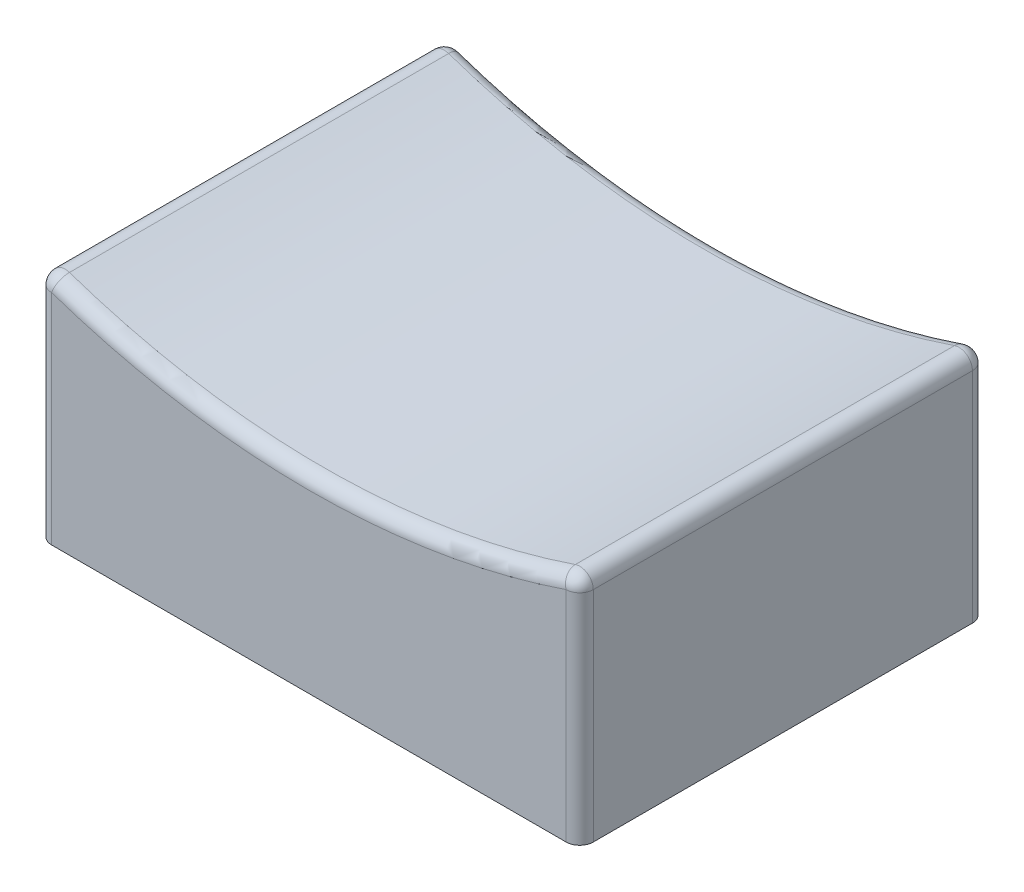
ISO-10303-21;
HEADER;
FILE_DESCRIPTION(('STEP AP214'),'2;1');
FILE_NAME('part.step','',(''),(''),'','','');
FILE_SCHEMA(('AUTOMOTIVE_DESIGN { 1 0 10303 214 1 1 1 1 }'));
ENDSEC;
DATA;
#1=APPLICATION_CONTEXT('core data for automotive mechanical design processes');
#2=APPLICATION_PROTOCOL_DEFINITION('international standard','automotive_design',2000,#1);
#3=PRODUCT_CONTEXT('',#1,'mechanical');
#4=PRODUCT('Part','Part','',(#3));
#5=PRODUCT_RELATED_PRODUCT_CATEGORY('part','',(#4));
#6=PRODUCT_DEFINITION_FORMATION('','',#4);
#7=PRODUCT_DEFINITION_CONTEXT('part definition',#1,'design');
#8=PRODUCT_DEFINITION('design','',#6,#7);
#9=PRODUCT_DEFINITION_SHAPE('','',#8);
#10=(LENGTH_UNIT() NAMED_UNIT(*) SI_UNIT(.MILLI.,.METRE.));
#11=(NAMED_UNIT(*) PLANE_ANGLE_UNIT() SI_UNIT($,.RADIAN.));
#12=(NAMED_UNIT(*) SI_UNIT($,.STERADIAN.) SOLID_ANGLE_UNIT());
#13=UNCERTAINTY_MEASURE_WITH_UNIT(LENGTH_MEASURE(1.E-05),#10,'distance_accuracy_value','');
#14=(GEOMETRIC_REPRESENTATION_CONTEXT(3) GLOBAL_UNCERTAINTY_ASSIGNED_CONTEXT((#13)) GLOBAL_UNIT_ASSIGNED_CONTEXT((#10,
#11,#12)) REPRESENTATION_CONTEXT('',''));
#15=CARTESIAN_POINT('',(0.,0.,0.));
#16=DIRECTION('',(0.,0.,1.));
#17=DIRECTION('',(1.,0.,0.));
#18=AXIS2_PLACEMENT_3D('',#15,#16,#17);
#19=CARTESIAN_POINT('',(0.,0.,15.));
#20=DIRECTION('',(1.,0.,0.));
#21=DIRECTION('',(0.,1.,0.));
#22=AXIS2_PLACEMENT_3D('',#19,#20,#21);
#23=PLANE('',#22);
#24=DIRECTION('',(0.,0.,-1.));
#25=VECTOR('',#24,1.);
#26=CARTESIAN_POINT('',(0.,8.07151991246213,15.));
#27=LINE('',#26,#25);
#28=CARTESIAN_POINT('',(0.,8.07151991246213,14.5));
#29=VERTEX_POINT('',#28);
#30=CARTESIAN_POINT('',(0.,8.07151991246213,0.5));
#31=VERTEX_POINT('',#30);
#32=EDGE_CURVE('E163',#29,#31,#27,.T.);
#33=ORIENTED_EDGE('',*,*,#32,.T.);
#34=DIRECTION('',(0.,-1.,0.));
#35=VECTOR('',#34,1.);
#36=CARTESIAN_POINT('',(0.,0.,0.5));
#37=LINE('',#36,#35);
#38=CARTESIAN_POINT('',(0.,0.,0.5));
#39=VERTEX_POINT('',#38);
#40=EDGE_CURVE('E165',#31,#39,#37,.T.);
#41=ORIENTED_EDGE('',*,*,#40,.T.);
#42=DIRECTION('',(0.,0.,-1.));
#43=VECTOR('',#42,1.);
#44=CARTESIAN_POINT('',(0.,0.,15.));
#45=LINE('',#44,#43);
#46=CARTESIAN_POINT('',(0.,0.,14.5));
#47=VERTEX_POINT('',#46);
#48=EDGE_CURVE('E140',#47,#39,#45,.T.);
#49=ORIENTED_EDGE('',*,*,#48,.F.);
#50=DIRECTION('',(0.,-1.,0.));
#51=VECTOR('',#50,1.);
#52=CARTESIAN_POINT('',(0.,8.77868482236761,14.5));
#53=LINE('',#52,#51);
#54=EDGE_CURVE('E161',#47,#29,#53,.F.);
#55=ORIENTED_EDGE('',*,*,#54,.T.);
#56=EDGE_LOOP('',(#33,#41,#49,#55));
#57=FACE_BOUND('',#56,.T.);
#58=ADVANCED_FACE('F33',(#57),#23,.F.);
#59=CARTESIAN_POINT('',(0.,0.,15.));
#60=DIRECTION('',(0.,1.,0.));
#61=DIRECTION('',(0.,0.,1.));
#62=AXIS2_PLACEMENT_3D('',#59,#60,#61);
#63=PLANE('',#62);
#64=DIRECTION('',(1.,0.,0.));
#65=VECTOR('',#64,1.);
#66=CARTESIAN_POINT('',(0.,0.,0.));
#67=LINE('',#66,#65);
#68=CARTESIAN_POINT('',(0.5,0.,0.));
#69=VERTEX_POINT('',#68);
#70=CARTESIAN_POINT('',(19.5,0.,0.));
#71=VERTEX_POINT('',#70);
#72=EDGE_CURVE('E198',#69,#71,#67,.T.);
#73=ORIENTED_EDGE('',*,*,#72,.T.);
#74=CARTESIAN_POINT('',(19.5,0.,0.5));
#75=DIRECTION('',(0.,1.,0.));
#76=DIRECTION('',(0.,0.,1.));
#77=AXIS2_PLACEMENT_3D('',#74,#75,#76);
#78=CIRCLE('',#77,0.5);
#79=CARTESIAN_POINT('',(20.,0.,0.5));
#80=VERTEX_POINT('',#79);
#81=EDGE_CURVE('E11',#71,#80,#78,.F.);
#82=ORIENTED_EDGE('',*,*,#81,.T.);
#83=DIRECTION('',(0.,0.,-1.));
#84=VECTOR('',#83,1.);
#85=CARTESIAN_POINT('',(20.,0.,15.));
#86=LINE('',#85,#84);
#87=CARTESIAN_POINT('',(20.,0.,14.5));
#88=VERTEX_POINT('',#87);
#89=EDGE_CURVE('E206',#88,#80,#86,.T.);
#90=ORIENTED_EDGE('',*,*,#89,.F.);
#91=CARTESIAN_POINT('',(19.5,0.,14.5));
#92=DIRECTION('',(0.,1.,0.));
#93=DIRECTION('',(0.,0.,1.));
#94=AXIS2_PLACEMENT_3D('',#91,#92,#93);
#95=CIRCLE('',#94,0.5);
#96=CARTESIAN_POINT('',(19.5,0.,15.));
#97=VERTEX_POINT('',#96);
#98=EDGE_CURVE('E173',#88,#97,#95,.F.);
#99=ORIENTED_EDGE('',*,*,#98,.T.);
#100=DIRECTION('',(1.,0.,0.));
#101=VECTOR('',#100,1.);
#102=CARTESIAN_POINT('',(0.,0.,15.));
#103=LINE('',#102,#101);
#104=CARTESIAN_POINT('',(0.5,0.,15.));
#105=VERTEX_POINT('',#104);
#106=EDGE_CURVE('E201',#105,#97,#103,.T.);
#107=ORIENTED_EDGE('',*,*,#106,.F.);
#108=CARTESIAN_POINT('',(0.5,0.,14.5));
#109=DIRECTION('',(0.,1.,0.));
#110=DIRECTION('',(0.,0.,1.));
#111=AXIS2_PLACEMENT_3D('',#108,#109,#110);
#112=CIRCLE('',#111,0.5);
#113=EDGE_CURVE('E171',#105,#47,#112,.F.);
#114=ORIENTED_EDGE('',*,*,#113,.T.);
#115=ORIENTED_EDGE('',*,*,#48,.T.);
#116=CARTESIAN_POINT('',(0.5,0.,0.5));
#117=DIRECTION('',(0.,1.,0.));
#118=DIRECTION('',(0.,0.,1.));
#119=AXIS2_PLACEMENT_3D('',#116,#117,#118);
#120=CIRCLE('',#119,0.5);
#121=EDGE_CURVE('E42',#39,#69,#120,.F.);
#122=ORIENTED_EDGE('',*,*,#121,.T.);
#123=EDGE_LOOP('',(#73,#82,#90,#99,#107,#114,#115,#122));
#124=FACE_BOUND('',#123,.T.);
#125=ADVANCED_FACE('F251',(#124),#63,.F.);
#126=CARTESIAN_POINT('',(20.,0.,15.));
#127=DIRECTION('',(-1.,0.,0.));
#128=DIRECTION('',(0.,-1.,0.));
#129=AXIS2_PLACEMENT_3D('',#126,#127,#128);
#130=PLANE('',#129);
#131=ORIENTED_EDGE('',*,*,#89,.T.);
#132=DIRECTION('',(0.,1.,0.));
#133=VECTOR('',#132,1.);
#134=CARTESIAN_POINT('',(20.,0.,0.5));
#135=LINE('',#134,#133);
#136=CARTESIAN_POINT('',(20.,8.07151991246213,0.5));
#137=VERTEX_POINT('',#136);
#138=EDGE_CURVE('E153',#80,#137,#135,.T.);
#139=ORIENTED_EDGE('',*,*,#138,.T.);
#140=DIRECTION('',(0.,0.,-1.));
#141=VECTOR('',#140,1.);
#142=CARTESIAN_POINT('',(20.,8.07151991246213,15.));
#143=LINE('',#142,#141);
#144=CARTESIAN_POINT('',(20.,8.07151991246213,14.5));
#145=VERTEX_POINT('',#144);
#146=EDGE_CURVE('E118',#137,#145,#143,.F.);
#147=ORIENTED_EDGE('',*,*,#146,.T.);
#148=DIRECTION('',(0.,1.,0.));
#149=VECTOR('',#148,1.);
#150=CARTESIAN_POINT('',(20.,0.,14.5));
#151=LINE('',#150,#149);
#152=EDGE_CURVE('E146',#145,#88,#151,.F.);
#153=ORIENTED_EDGE('',*,*,#152,.T.);
#154=EDGE_LOOP('',(#131,#139,#147,#153));
#155=FACE_BOUND('',#154,.T.);
#156=ADVANCED_FACE('F231',(#155),#130,.F.);
#157=CARTESIAN_POINT('',(10.,36.,15.));
#158=DIRECTION('',(0.,0.,-1.));
#159=DIRECTION('',(-1.,0.,0.));
#160=AXIS2_PLACEMENT_3D('',#157,#158,#159);
#161=CYLINDRICAL_SURFACE('',#160,29.);
#162=CARTESIAN_POINT('',(10.,36.,14.5));
#163=DIRECTION('',(0.,0.,1.));
#164=DIRECTION('',(1.,0.,0.));
#165=AXIS2_PLACEMENT_3D('',#162,#163,#164);
#166=CIRCLE('',#165,29.);
#167=CARTESIAN_POINT('',(0.661016949152546,8.54488398174243,14.5));
#168=VERTEX_POINT('',#167);
#169=CARTESIAN_POINT('',(19.3389830508475,8.54488398174243,14.5));
#170=VERTEX_POINT('',#169);
#171=EDGE_CURVE('E144',#168,#170,#166,.T.);
#172=ORIENTED_EDGE('',*,*,#171,.T.);
#173=DIRECTION('',(0.,0.,-1.));
#174=VECTOR('',#173,1.);
#175=CARTESIAN_POINT('',(19.3389830508475,8.54488398174243,15.));
#176=LINE('',#175,#174);
#177=CARTESIAN_POINT('',(19.3389830508475,8.54488398174243,0.5));
#178=VERTEX_POINT('',#177);
#179=EDGE_CURVE('E116',#170,#178,#176,.T.);
#180=ORIENTED_EDGE('',*,*,#179,.T.);
#181=CARTESIAN_POINT('',(10.,36.,0.5));
#182=DIRECTION('',(0.,0.,1.));
#183=DIRECTION('',(1.,0.,0.));
#184=AXIS2_PLACEMENT_3D('',#181,#182,#183);
#185=CIRCLE('',#184,29.);
#186=CARTESIAN_POINT('',(0.661016949152546,8.54488398174243,0.5));
#187=VERTEX_POINT('',#186);
#188=EDGE_CURVE('E133',#178,#187,#185,.F.);
#189=ORIENTED_EDGE('',*,*,#188,.T.);
#190=DIRECTION('',(0.,0.,-1.));
#191=VECTOR('',#190,1.);
#192=CARTESIAN_POINT('',(0.661016949152543,8.54488398174243,15.));
#193=LINE('',#192,#191);
#194=EDGE_CURVE('E139',#187,#168,#193,.F.);
#195=ORIENTED_EDGE('',*,*,#194,.T.);
#196=EDGE_LOOP('',(#172,#180,#189,#195));
#197=FACE_BOUND('',#196,.T.);
#198=ADVANCED_FACE('F142',(#197),#161,.F.);
#199=CARTESIAN_POINT('',(10.,36.,15.));
#200=DIRECTION('',(0.,0.,1.));
#201=DIRECTION('',(1.,0.,0.));
#202=AXIS2_PLACEMENT_3D('',#199,#200,#201);
#203=PLANE('',#202);
#204=ORIENTED_EDGE('',*,*,#106,.T.);
#205=DIRECTION('',(0.,1.,0.));
#206=VECTOR('',#205,1.);
#207=CARTESIAN_POINT('',(19.5,8.77868482236761,15.));
#208=LINE('',#207,#206);
#209=CARTESIAN_POINT('',(19.5,8.07151991246213,15.));
#210=VERTEX_POINT('',#209);
#211=EDGE_CURVE('E159',#97,#210,#208,.T.);
#212=ORIENTED_EDGE('',*,*,#211,.T.);
#213=CARTESIAN_POINT('',(10.,36.,15.));
#214=DIRECTION('',(0.,0.,1.));
#215=DIRECTION('',(1.,0.,0.));
#216=AXIS2_PLACEMENT_3D('',#213,#214,#215);
#217=CIRCLE('',#216,29.5);
#218=CARTESIAN_POINT('',(0.500000000000003,8.07151991246212,15.));
#219=VERTEX_POINT('',#218);
#220=EDGE_CURVE('E157',#210,#219,#217,.F.);
#221=ORIENTED_EDGE('',*,*,#220,.T.);
#222=DIRECTION('',(0.,-1.,0.));
#223=VECTOR('',#222,1.);
#224=CARTESIAN_POINT('',(0.5,0.,15.));
#225=LINE('',#224,#223);
#226=EDGE_CURVE('E155',#219,#105,#225,.T.);
#227=ORIENTED_EDGE('',*,*,#226,.T.);
#228=EDGE_LOOP('',(#204,#212,#221,#227));
#229=FACE_BOUND('',#228,.T.);
#230=ADVANCED_FACE('F348',(#229),#203,.T.);
#231=CARTESIAN_POINT('',(10.,36.,0.));
#232=DIRECTION('',(0.,0.,1.));
#233=DIRECTION('',(1.,0.,0.));
#234=AXIS2_PLACEMENT_3D('',#231,#232,#233);
#235=PLANE('',#234);
#236=CARTESIAN_POINT('',(10.,36.,0.));
#237=DIRECTION('',(0.,0.,1.));
#238=DIRECTION('',(1.,0.,0.));
#239=AXIS2_PLACEMENT_3D('',#236,#237,#238);
#240=CIRCLE('',#239,29.5);
#241=CARTESIAN_POINT('',(0.500000000000003,8.07151991246212,0.));
#242=VERTEX_POINT('',#241);
#243=CARTESIAN_POINT('',(19.5,8.07151991246213,0.));
#244=VERTEX_POINT('',#243);
#245=EDGE_CURVE('E50',#242,#244,#240,.T.);
#246=ORIENTED_EDGE('',*,*,#245,.T.);
#247=DIRECTION('',(0.,1.,0.));
#248=VECTOR('',#247,1.);
#249=CARTESIAN_POINT('',(19.5,36.,0.));
#250=LINE('',#249,#248);
#251=EDGE_CURVE('E169',#244,#71,#250,.F.);
#252=ORIENTED_EDGE('',*,*,#251,.T.);
#253=ORIENTED_EDGE('',*,*,#72,.F.);
#254=DIRECTION('',(0.,-1.,0.));
#255=VECTOR('',#254,1.);
#256=CARTESIAN_POINT('',(0.500000000000014,36.,0.));
#257=LINE('',#256,#255);
#258=EDGE_CURVE('E55',#69,#242,#257,.F.);
#259=ORIENTED_EDGE('',*,*,#258,.T.);
#260=EDGE_LOOP('',(#246,#252,#253,#259));
#261=FACE_BOUND('',#260,.T.);
#262=ADVANCED_FACE('F235',(#261),#235,.F.);
#263=CARTESIAN_POINT('',(0.500000000000014,36.,14.5));
#264=DIRECTION('',(0.,1.,0.));
#265=DIRECTION('',(-1.,0.,0.));
#266=AXIS2_PLACEMENT_3D('',#263,#264,#265);
#267=CYLINDRICAL_SURFACE('',#266,0.5);
#268=ORIENTED_EDGE('',*,*,#113,.F.);
#269=ORIENTED_EDGE('',*,*,#226,.F.);
#270=CARTESIAN_POINT('',(0.500000000000003,8.07151991246213,14.5));
#271=DIRECTION('',(0.,1.,0.));
#272=DIRECTION('',(0.,0.,1.));
#273=AXIS2_PLACEMENT_3D('',#270,#271,#272);
#274=CIRCLE('',#273,0.5);
#275=EDGE_CURVE('E37',#29,#219,#274,.T.);
#276=ORIENTED_EDGE('',*,*,#275,.F.);
#277=ORIENTED_EDGE('',*,*,#54,.F.);
#278=EDGE_LOOP('',(#268,#269,#276,#277));
#279=FACE_BOUND('',#278,.T.);
#280=ADVANCED_FACE('F35',(#279),#267,.T.);
#281=CARTESIAN_POINT('',(0.500000000000003,8.07151991246213,15.));
#282=DIRECTION('',(0.,0.,-1.));
#283=DIRECTION('',(-1.,0.,0.));
#284=AXIS2_PLACEMENT_3D('',#281,#282,#283);
#285=CYLINDRICAL_SURFACE('',#284,0.5);
#286=CARTESIAN_POINT('',(0.500000000000003,8.07151991246213,0.5));
#287=DIRECTION('',(0.,0.,-1.));
#288=DIRECTION('',(-1.,0.,0.));
#289=AXIS2_PLACEMENT_3D('',#286,#287,#288);
#290=CIRCLE('',#289,0.5);
#291=EDGE_CURVE('E190',#31,#187,#290,.T.);
#292=ORIENTED_EDGE('',*,*,#291,.F.);
#293=ORIENTED_EDGE('',*,*,#32,.F.);
#294=CARTESIAN_POINT('',(0.500000000000003,8.07151991246213,14.5));
#295=DIRECTION('',(0.,0.,1.));
#296=DIRECTION('',(1.,0.,0.));
#297=AXIS2_PLACEMENT_3D('',#294,#295,#296);
#298=CIRCLE('',#297,0.5);
#299=EDGE_CURVE('E192',#168,#29,#298,.T.);
#300=ORIENTED_EDGE('',*,*,#299,.F.);
#301=ORIENTED_EDGE('',*,*,#194,.F.);
#302=EDGE_LOOP('',(#292,#293,#300,#301));
#303=FACE_BOUND('',#302,.T.);
#304=ADVANCED_FACE('F215',(#303),#285,.T.);
#305=CARTESIAN_POINT('',(0.5,0.,0.5));
#306=DIRECTION('',(0.,-1.,0.));
#307=DIRECTION('',(1.,0.,0.));
#308=AXIS2_PLACEMENT_3D('',#305,#306,#307);
#309=CYLINDRICAL_SURFACE('',#308,0.5);
#310=ORIENTED_EDGE('',*,*,#121,.F.);
#311=ORIENTED_EDGE('',*,*,#40,.F.);
#312=CARTESIAN_POINT('',(0.500000000000003,8.07151991246212,0.5));
#313=DIRECTION('',(0.,1.,0.));
#314=DIRECTION('',(-1.,0.,0.));
#315=AXIS2_PLACEMENT_3D('',#312,#313,#314);
#316=CIRCLE('',#315,0.5);
#317=EDGE_CURVE('E187',#242,#31,#316,.T.);
#318=ORIENTED_EDGE('',*,*,#317,.F.);
#319=ORIENTED_EDGE('',*,*,#258,.F.);
#320=EDGE_LOOP('',(#310,#311,#318,#319));
#321=FACE_BOUND('',#320,.T.);
#322=ADVANCED_FACE('F238',(#321),#309,.T.);
#323=CARTESIAN_POINT('',(0.500000000000003,8.07151991246213,14.5));
#324=DIRECTION('',(0.,0.,1.));
#325=DIRECTION('',(1.,0.,0.));
#326=AXIS2_PLACEMENT_3D('',#323,#324,#325);
#327=SPHERICAL_SURFACE('',#326,0.5);
#328=ORIENTED_EDGE('',*,*,#299,.T.);
#329=ORIENTED_EDGE('',*,*,#275,.T.);
#330=CARTESIAN_POINT('',(0.500000000000003,8.07151991246212,14.5));
#331=DIRECTION('',(-0.946728138560607,0.322033898305082,0.));
#332=DIRECTION('',(-0.322033898305082,-0.946728138560607,0.));
#333=AXIS2_PLACEMENT_3D('',#330,#331,#332);
#334=CIRCLE('',#333,0.5);
#335=EDGE_CURVE('E184',#168,#219,#334,.F.);
#336=ORIENTED_EDGE('',*,*,#335,.F.);
#337=EDGE_LOOP('',(#328,#329,#336));
#338=FACE_BOUND('',#337,.T.);
#339=ADVANCED_FACE('F216',(#338),#327,.T.);
#340=CARTESIAN_POINT('',(0.500000000000003,8.07151991246213,0.5));
#341=DIRECTION('',(0.,0.,1.));
#342=DIRECTION('',(1.,0.,0.));
#343=AXIS2_PLACEMENT_3D('',#340,#341,#342);
#344=SPHERICAL_SURFACE('',#343,0.5);
#345=ORIENTED_EDGE('',*,*,#317,.T.);
#346=ORIENTED_EDGE('',*,*,#291,.T.);
#347=CARTESIAN_POINT('',(0.500000000000003,8.07151991246213,0.5));
#348=DIRECTION('',(-0.946728138560606,0.322033898305085,0.));
#349=DIRECTION('',(-0.322033898305085,-0.946728138560606,0.));
#350=AXIS2_PLACEMENT_3D('',#347,#348,#349);
#351=CIRCLE('',#350,0.5);
#352=EDGE_CURVE('E136',#242,#187,#351,.F.);
#353=ORIENTED_EDGE('',*,*,#352,.F.);
#354=EDGE_LOOP('',(#345,#346,#353));
#355=FACE_BOUND('',#354,.T.);
#356=ADVANCED_FACE('F241',(#355),#344,.T.);
#357=CARTESIAN_POINT('',(19.5,36.,14.5));
#358=DIRECTION('',(0.,-1.,0.));
#359=DIRECTION('',(1.,0.,0.));
#360=AXIS2_PLACEMENT_3D('',#357,#358,#359);
#361=CYLINDRICAL_SURFACE('',#360,0.5);
#362=ORIENTED_EDGE('',*,*,#98,.F.);
#363=ORIENTED_EDGE('',*,*,#152,.F.);
#364=CARTESIAN_POINT('',(19.5,8.07151991246213,14.5));
#365=DIRECTION('',(0.,1.,0.));
#366=DIRECTION('',(-1.,0.,0.));
#367=AXIS2_PLACEMENT_3D('',#364,#365,#366);
#368=CIRCLE('',#367,0.5);
#369=EDGE_CURVE('E180',#210,#145,#368,.T.);
#370=ORIENTED_EDGE('',*,*,#369,.F.);
#371=ORIENTED_EDGE('',*,*,#211,.F.);
#372=EDGE_LOOP('',(#362,#363,#370,#371));
#373=FACE_BOUND('',#372,.T.);
#374=ADVANCED_FACE('F228',(#373),#361,.T.);
#375=CARTESIAN_POINT('',(10.,36.,14.5));
#376=DIRECTION('',(0.,0.,1.));
#377=DIRECTION('',(1.,0.,0.));
#378=AXIS2_PLACEMENT_3D('',#375,#376,#377);
#379=TOROIDAL_SURFACE('',#378,29.5,0.5);
#380=ORIENTED_EDGE('',*,*,#335,.T.);
#381=ORIENTED_EDGE('',*,*,#220,.F.);
#382=CARTESIAN_POINT('',(19.5,8.07151991246213,14.5));
#383=DIRECTION('',(0.946728138560607,0.322033898305083,0.));
#384=DIRECTION('',(-0.322033898305083,0.946728138560607,0.));
#385=AXIS2_PLACEMENT_3D('',#382,#383,#384);
#386=CIRCLE('',#385,0.5);
#387=EDGE_CURVE('E130',#170,#210,#386,.T.);
#388=ORIENTED_EDGE('',*,*,#387,.F.);
#389=ORIENTED_EDGE('',*,*,#171,.F.);
#390=EDGE_LOOP('',(#380,#381,#388,#389));
#391=FACE_BOUND('',#390,.T.);
#392=ADVANCED_FACE('F219',(#391),#379,.T.);
#393=CARTESIAN_POINT('',(10.,36.,0.5));
#394=DIRECTION('',(0.,0.,1.));
#395=DIRECTION('',(1.,0.,0.));
#396=AXIS2_PLACEMENT_3D('',#393,#394,#395);
#397=TOROIDAL_SURFACE('',#396,29.5,0.5);
#398=ORIENTED_EDGE('',*,*,#352,.T.);
#399=ORIENTED_EDGE('',*,*,#188,.F.);
#400=CARTESIAN_POINT('',(19.5,8.07151991246213,0.5));
#401=DIRECTION('',(0.946728138560607,0.322033898305083,0.));
#402=DIRECTION('',(-0.322033898305083,0.946728138560607,0.));
#403=AXIS2_PLACEMENT_3D('',#400,#401,#402);
#404=CIRCLE('',#403,0.5);
#405=EDGE_CURVE('E124',#244,#178,#404,.T.);
#406=ORIENTED_EDGE('',*,*,#405,.F.);
#407=ORIENTED_EDGE('',*,*,#245,.F.);
#408=EDGE_LOOP('',(#398,#399,#406,#407));
#409=FACE_BOUND('',#408,.T.);
#410=ADVANCED_FACE('F134',(#409),#397,.T.);
#411=CARTESIAN_POINT('',(19.5,0.,0.5));
#412=DIRECTION('',(0.,1.,0.));
#413=DIRECTION('',(-1.,0.,0.));
#414=AXIS2_PLACEMENT_3D('',#411,#412,#413);
#415=CYLINDRICAL_SURFACE('',#414,0.5);
#416=ORIENTED_EDGE('',*,*,#81,.F.);
#417=ORIENTED_EDGE('',*,*,#251,.F.);
#418=CARTESIAN_POINT('',(19.5,8.07151991246213,0.5));
#419=DIRECTION('',(0.,1.,0.));
#420=DIRECTION('',(0.,0.,1.));
#421=AXIS2_PLACEMENT_3D('',#418,#419,#420);
#422=CIRCLE('',#421,0.5);
#423=EDGE_CURVE('E128',#137,#244,#422,.T.);
#424=ORIENTED_EDGE('',*,*,#423,.F.);
#425=ORIENTED_EDGE('',*,*,#138,.F.);
#426=EDGE_LOOP('',(#416,#417,#424,#425));
#427=FACE_BOUND('',#426,.T.);
#428=ADVANCED_FACE('F234',(#427),#415,.T.);
#429=CARTESIAN_POINT('',(19.5,8.07151991246213,14.5));
#430=DIRECTION('',(0.,0.,1.));
#431=DIRECTION('',(1.,0.,0.));
#432=AXIS2_PLACEMENT_3D('',#429,#430,#431);
#433=SPHERICAL_SURFACE('',#432,0.5);
#434=ORIENTED_EDGE('',*,*,#387,.T.);
#435=ORIENTED_EDGE('',*,*,#369,.T.);
#436=CARTESIAN_POINT('',(19.5,8.07151991246213,14.5));
#437=DIRECTION('',(0.,0.,1.));
#438=DIRECTION('',(1.,0.,0.));
#439=AXIS2_PLACEMENT_3D('',#436,#437,#438);
#440=CIRCLE('',#439,0.5);
#441=EDGE_CURVE('E121',#170,#145,#440,.F.);
#442=ORIENTED_EDGE('',*,*,#441,.F.);
#443=EDGE_LOOP('',(#434,#435,#442));
#444=FACE_BOUND('',#443,.T.);
#445=ADVANCED_FACE('F223',(#444),#433,.T.);
#446=CARTESIAN_POINT('',(19.5,8.07151991246213,0.5));
#447=DIRECTION('',(0.,0.,1.));
#448=DIRECTION('',(1.,0.,0.));
#449=AXIS2_PLACEMENT_3D('',#446,#447,#448);
#450=SPHERICAL_SURFACE('',#449,0.5);
#451=ORIENTED_EDGE('',*,*,#423,.T.);
#452=ORIENTED_EDGE('',*,*,#405,.T.);
#453=CARTESIAN_POINT('',(19.5,8.07151991246213,0.5));
#454=DIRECTION('',(0.,0.,-1.));
#455=DIRECTION('',(-1.,0.,0.));
#456=AXIS2_PLACEMENT_3D('',#453,#454,#455);
#457=CIRCLE('',#456,0.5);
#458=EDGE_CURVE('E112',#137,#178,#457,.F.);
#459=ORIENTED_EDGE('',*,*,#458,.F.);
#460=EDGE_LOOP('',(#451,#452,#459));
#461=FACE_BOUND('',#460,.T.);
#462=ADVANCED_FACE('F126',(#461),#450,.T.);
#463=CARTESIAN_POINT('',(19.5,8.07151991246213,15.));
#464=DIRECTION('',(0.,0.,-1.));
#465=DIRECTION('',(-1.,0.,0.));
#466=AXIS2_PLACEMENT_3D('',#463,#464,#465);
#467=CYLINDRICAL_SURFACE('',#466,0.5);
#468=ORIENTED_EDGE('',*,*,#441,.T.);
#469=ORIENTED_EDGE('',*,*,#146,.F.);
#470=ORIENTED_EDGE('',*,*,#458,.T.);
#471=ORIENTED_EDGE('',*,*,#179,.F.);
#472=EDGE_LOOP('',(#468,#469,#470,#471));
#473=FACE_BOUND('',#472,.T.);
#474=ADVANCED_FACE('F114',(#473),#467,.T.);
#475=CLOSED_SHELL('',(#58,#125,#156,#198,#230,#262,#280,#304,#322,#339,#356,#374,#392,#410,#428,
#445,#462,#474));
#476=MANIFOLD_SOLID_BREP('B2',#475);
#477=ADVANCED_BREP_SHAPE_REPRESENTATION('',(#18,#476),#14);
#478=SHAPE_DEFINITION_REPRESENTATION(#9,#477);
ENDSEC;
END-ISO-10303-21;
